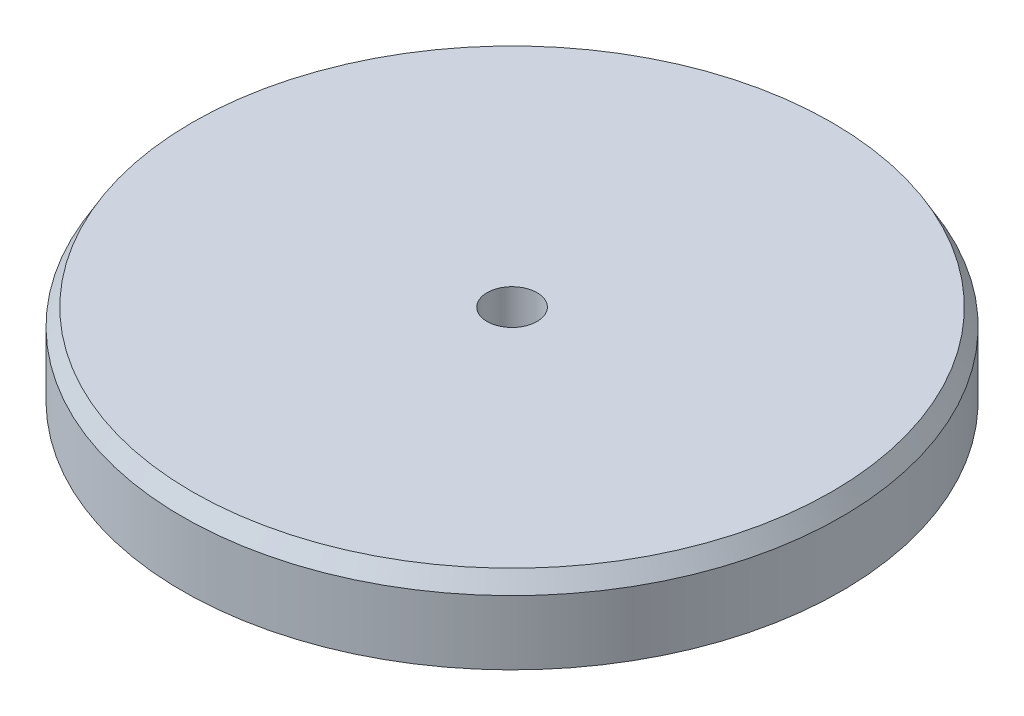
ISO-10303-21;
HEADER;
FILE_DESCRIPTION(('STEP AP214'),'2;1');
FILE_NAME('part.step','',(''),(''),'','','');
FILE_SCHEMA(('AUTOMOTIVE_DESIGN { 1 0 10303 214 1 1 1 1 }'));
ENDSEC;
DATA;
#1=APPLICATION_CONTEXT('core data for automotive mechanical design processes');
#2=APPLICATION_PROTOCOL_DEFINITION('international standard','automotive_design',2000,#1);
#3=PRODUCT_CONTEXT('',#1,'mechanical');
#4=PRODUCT('Part','Part','',(#3));
#5=PRODUCT_RELATED_PRODUCT_CATEGORY('part','',(#4));
#6=PRODUCT_DEFINITION_FORMATION('','',#4);
#7=PRODUCT_DEFINITION_CONTEXT('part definition',#1,'design');
#8=PRODUCT_DEFINITION('design','',#6,#7);
#9=PRODUCT_DEFINITION_SHAPE('','',#8);
#10=(LENGTH_UNIT() NAMED_UNIT(*) SI_UNIT(.MILLI.,.METRE.));
#11=(NAMED_UNIT(*) PLANE_ANGLE_UNIT() SI_UNIT($,.RADIAN.));
#12=(NAMED_UNIT(*) SI_UNIT($,.STERADIAN.) SOLID_ANGLE_UNIT());
#13=UNCERTAINTY_MEASURE_WITH_UNIT(LENGTH_MEASURE(1.E-05),#10,'distance_accuracy_value','');
#14=(GEOMETRIC_REPRESENTATION_CONTEXT(3) GLOBAL_UNCERTAINTY_ASSIGNED_CONTEXT((#13)) GLOBAL_UNIT_ASSIGNED_CONTEXT((#10,
#11,#12)) REPRESENTATION_CONTEXT('',''));
#15=CARTESIAN_POINT('',(0.,0.,0.));
#16=DIRECTION('',(0.,0.,1.));
#17=DIRECTION('',(1.,0.,0.));
#18=AXIS2_PLACEMENT_3D('',#15,#16,#17);
#19=CARTESIAN_POINT('',(0.,0.,5.08));
#20=DIRECTION('',(0.,1.,0.));
#21=DIRECTION('',(0.,0.,1.));
#22=AXIS2_PLACEMENT_3D('',#19,#20,#21);
#23=PLANE('',#22);
#24=CARTESIAN_POINT('',(0.,0.,0.));
#25=DIRECTION('',(0.,-1.,0.));
#26=DIRECTION('',(0.,0.,-1.));
#27=AXIS2_PLACEMENT_3D('',#24,#25,#26);
#28=CIRCLE('',#27,0.9779);
#29=CARTESIAN_POINT('',(0.,0.,-0.9779));
#30=VERTEX_POINT('',#29);
#31=EDGE_CURVE('E73',#30,#30,#28,.T.);
#32=ORIENTED_EDGE('',*,*,#31,.F.);
#33=EDGE_LOOP('',(#32));
#34=FACE_BOUND('',#33,.T.);
#35=CARTESIAN_POINT('',(0.,0.,0.));
#36=DIRECTION('',(0.,-1.,0.));
#37=DIRECTION('',(0.,0.,-1.));
#38=AXIS2_PLACEMENT_3D('',#35,#36,#37);
#39=CIRCLE('',#38,5.08);
#40=CARTESIAN_POINT('',(0.,0.,-5.08));
#41=VERTEX_POINT('',#40);
#42=EDGE_CURVE('E50',#41,#41,#39,.T.);
#43=ORIENTED_EDGE('',*,*,#42,.T.);
#44=EDGE_LOOP('',(#43));
#45=FACE_BOUND('',#44,.T.);
#46=ADVANCED_FACE('F37',(#34,#45),#23,.F.);
#47=CARTESIAN_POINT('',(0.,0.,0.));
#48=DIRECTION('',(0.,-1.,0.));
#49=DIRECTION('',(0.,0.,-1.));
#50=AXIS2_PLACEMENT_3D('',#47,#48,#49);
#51=CYLINDRICAL_SURFACE('',#50,5.08);
#52=ORIENTED_EDGE('',*,*,#42,.F.);
#53=EDGE_LOOP('',(#52));
#54=FACE_BOUND('',#53,.T.);
#55=CARTESIAN_POINT('',(0.,1.90499999999998,0.));
#56=DIRECTION('',(0.,-1.,0.));
#57=DIRECTION('',(0.,0.,-1.));
#58=AXIS2_PLACEMENT_3D('',#55,#56,#57);
#59=CIRCLE('',#58,5.08);
#60=CARTESIAN_POINT('',(0.,1.90499999999998,-5.08));
#61=VERTEX_POINT('',#60);
#62=EDGE_CURVE('E55',#61,#61,#59,.T.);
#63=ORIENTED_EDGE('',*,*,#62,.T.);
#64=EDGE_LOOP('',(#63));
#65=FACE_BOUND('',#64,.T.);
#66=ADVANCED_FACE('F82',(#54,#65),#51,.T.);
#67=CARTESIAN_POINT('',(0.,1.905,0.));
#68=DIRECTION('',(0.,-1.,0.));
#69=DIRECTION('',(0.,0.,-1.));
#70=AXIS2_PLACEMENT_3D('',#67,#68,#69);
#71=TOROIDAL_SURFACE('',#70,7.62,2.54);
#72=ORIENTED_EDGE('',*,*,#62,.F.);
#73=EDGE_LOOP('',(#72));
#74=FACE_BOUND('',#73,.T.);
#75=CARTESIAN_POINT('',(0.,4.445,0.));
#76=DIRECTION('',(0.,-1.,0.));
#77=DIRECTION('',(0.,0.,-1.));
#78=AXIS2_PLACEMENT_3D('',#75,#76,#77);
#79=CIRCLE('',#78,7.62000000000002);
#80=CARTESIAN_POINT('',(0.,4.445,-7.62000000000002));
#81=VERTEX_POINT('',#80);
#82=EDGE_CURVE('E61',#81,#81,#79,.T.);
#83=ORIENTED_EDGE('',*,*,#82,.T.);
#84=EDGE_LOOP('',(#83));
#85=FACE_BOUND('',#84,.T.);
#86=ADVANCED_FACE('F87',(#74,#85),#71,.F.);
#87=CARTESIAN_POINT('',(0.,4.445,12.8905));
#88=DIRECTION('',(0.,1.,0.));
#89=DIRECTION('',(0.,0.,1.));
#90=AXIS2_PLACEMENT_3D('',#87,#88,#89);
#91=PLANE('',#90);
#92=ORIENTED_EDGE('',*,*,#82,.F.);
#93=EDGE_LOOP('',(#92));
#94=FACE_BOUND('',#93,.T.);
#95=CARTESIAN_POINT('',(0.,4.445,0.));
#96=DIRECTION('',(0.,-1.,0.));
#97=DIRECTION('',(0.,0.,-1.));
#98=AXIS2_PLACEMENT_3D('',#95,#96,#97);
#99=CIRCLE('',#98,12.8905);
#100=CARTESIAN_POINT('',(0.,4.445,-12.8905));
#101=VERTEX_POINT('',#100);
#102=EDGE_CURVE('E65',#101,#101,#99,.T.);
#103=ORIENTED_EDGE('',*,*,#102,.T.);
#104=EDGE_LOOP('',(#103));
#105=FACE_BOUND('',#104,.T.);
#106=ADVANCED_FACE('F93',(#94,#105),#91,.F.);
#107=CARTESIAN_POINT('',(0.,0.,0.));
#108=DIRECTION('',(0.,-1.,0.));
#109=DIRECTION('',(0.,0.,-1.));
#110=AXIS2_PLACEMENT_3D('',#107,#108,#109);
#111=CYLINDRICAL_SURFACE('',#110,12.8905);
#112=CARTESIAN_POINT('',(0.,6.96008864231627,0.));
#113=DIRECTION('',(0.,-1.,0.));
#114=DIRECTION('',(0.,0.,-1.));
#115=AXIS2_PLACEMENT_3D('',#112,#113,#114);
#116=CIRCLE('',#115,12.8905);
#117=CARTESIAN_POINT('',(0.,6.96008864231627,-12.8905));
#118=VERTEX_POINT('',#117);
#119=EDGE_CURVE('E45',#118,#118,#116,.T.);
#120=ORIENTED_EDGE('',*,*,#119,.T.);
#121=EDGE_LOOP('',(#120));
#122=FACE_BOUND('',#121,.T.);
#123=ORIENTED_EDGE('',*,*,#102,.F.);
#124=EDGE_LOOP('',(#123));
#125=FACE_BOUND('',#124,.T.);
#126=ADVANCED_FACE('F99',(#122,#125),#111,.T.);
#127=CARTESIAN_POINT('',(0.,7.62,0.9779));
#128=DIRECTION('',(0.,-1.,0.));
#129=DIRECTION('',(0.,0.,-1.));
#130=AXIS2_PLACEMENT_3D('',#127,#128,#129);
#131=PLANE('',#130);
#132=CARTESIAN_POINT('',(0.,7.62,0.));
#133=DIRECTION('',(0.,-1.,0.));
#134=DIRECTION('',(0.,0.,-1.));
#135=AXIS2_PLACEMENT_3D('',#132,#133,#134);
#136=CIRCLE('',#135,12.5095);
#137=CARTESIAN_POINT('',(0.,7.62,-12.5095));
#138=VERTEX_POINT('',#137);
#139=EDGE_CURVE('E10',#138,#138,#136,.F.);
#140=ORIENTED_EDGE('',*,*,#139,.T.);
#141=EDGE_LOOP('',(#140));
#142=FACE_BOUND('',#141,.T.);
#143=CARTESIAN_POINT('',(0.,7.62,0.));
#144=DIRECTION('',(0.,-1.,0.));
#145=DIRECTION('',(0.,0.,-1.));
#146=AXIS2_PLACEMENT_3D('',#143,#144,#145);
#147=CIRCLE('',#146,0.9779);
#148=CARTESIAN_POINT('',(0.,7.62,-0.9779));
#149=VERTEX_POINT('',#148);
#150=EDGE_CURVE('E69',#149,#149,#147,.T.);
#151=ORIENTED_EDGE('',*,*,#150,.T.);
#152=EDGE_LOOP('',(#151));
#153=FACE_BOUND('',#152,.T.);
#154=ADVANCED_FACE('F104',(#142,#153),#131,.F.);
#155=CARTESIAN_POINT('',(0.,0.,0.));
#156=DIRECTION('',(0.,-1.,0.));
#157=DIRECTION('',(0.,0.,-1.));
#158=AXIS2_PLACEMENT_3D('',#155,#156,#157);
#159=CYLINDRICAL_SURFACE('',#158,0.9779);
#160=ORIENTED_EDGE('',*,*,#150,.F.);
#161=EDGE_LOOP('',(#160));
#162=FACE_BOUND('',#161,.T.);
#163=ORIENTED_EDGE('',*,*,#31,.T.);
#164=EDGE_LOOP('',(#163));
#165=FACE_BOUND('',#164,.T.);
#166=ADVANCED_FACE('F78',(#162,#165),#159,.F.);
#167=CARTESIAN_POINT('',(0.,6.96008864231627,0.));
#168=DIRECTION('',(0.,-1.,0.));
#169=DIRECTION('',(0.,0.,-1.));
#170=AXIS2_PLACEMENT_3D('',#167,#168,#169);
#171=CONICAL_SURFACE('',#170,12.8905,0.523598775598301);
#172=ORIENTED_EDGE('',*,*,#139,.F.);
#173=EDGE_LOOP('',(#172));
#174=FACE_BOUND('',#173,.T.);
#175=ORIENTED_EDGE('',*,*,#119,.F.);
#176=EDGE_LOOP('',(#175));
#177=FACE_BOUND('',#176,.T.);
#178=ADVANCED_FACE('F39',(#174,#177),#171,.T.);
#179=CLOSED_SHELL('',(#46,#66,#86,#106,#126,#154,#166,#178));
#180=MANIFOLD_SOLID_BREP('B2',#179);
#181=ADVANCED_BREP_SHAPE_REPRESENTATION('',(#18,#180),#14);
#182=SHAPE_DEFINITION_REPRESENTATION(#9,#181);
ENDSEC;
END-ISO-10303-21;
